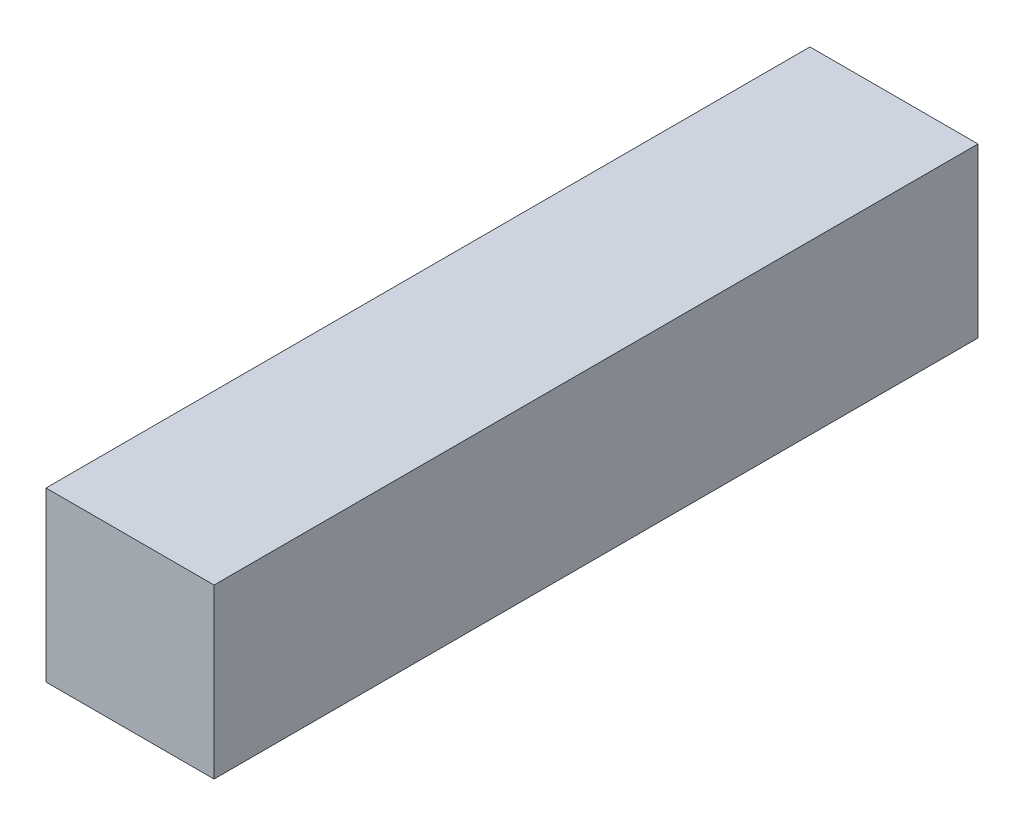
ISO-10303-21;
HEADER;
FILE_DESCRIPTION(('STEP AP214'),'2;1');
FILE_NAME('part.step','',(''),(''),'','','');
FILE_SCHEMA(('AUTOMOTIVE_DESIGN { 1 0 10303 214 1 1 1 1 }'));
ENDSEC;
DATA;
#1=APPLICATION_CONTEXT('core data for automotive mechanical design processes');
#2=APPLICATION_PROTOCOL_DEFINITION('international standard','automotive_design',2000,#1);
#3=PRODUCT_CONTEXT('',#1,'mechanical');
#4=PRODUCT('Part','Part','',(#3));
#5=PRODUCT_RELATED_PRODUCT_CATEGORY('part','',(#4));
#6=PRODUCT_DEFINITION_FORMATION('','',#4);
#7=PRODUCT_DEFINITION_CONTEXT('part definition',#1,'design');
#8=PRODUCT_DEFINITION('design','',#6,#7);
#9=PRODUCT_DEFINITION_SHAPE('','',#8);
#10=(LENGTH_UNIT() NAMED_UNIT(*) SI_UNIT(.MILLI.,.METRE.));
#11=(NAMED_UNIT(*) PLANE_ANGLE_UNIT() SI_UNIT($,.RADIAN.));
#12=(NAMED_UNIT(*) SI_UNIT($,.STERADIAN.) SOLID_ANGLE_UNIT());
#13=UNCERTAINTY_MEASURE_WITH_UNIT(LENGTH_MEASURE(1.E-05),#10,'distance_accuracy_value','');
#14=(GEOMETRIC_REPRESENTATION_CONTEXT(3) GLOBAL_UNCERTAINTY_ASSIGNED_CONTEXT((#13)) GLOBAL_UNIT_ASSIGNED_CONTEXT((#10,
#11,#12)) REPRESENTATION_CONTEXT('',''));
#15=CARTESIAN_POINT('',(0.,0.,0.));
#16=DIRECTION('',(0.,0.,1.));
#17=DIRECTION('',(1.,0.,0.));
#18=AXIS2_PLACEMENT_3D('',#15,#16,#17);
#19=CARTESIAN_POINT('',(11.,11.,100.));
#20=DIRECTION('',(-1.,0.,0.));
#21=DIRECTION('',(0.,-1.,0.));
#22=AXIS2_PLACEMENT_3D('',#19,#20,#21);
#23=PLANE('',#22);
#24=DIRECTION('',(0.,1.,0.));
#25=VECTOR('',#24,1.);
#26=CARTESIAN_POINT('',(11.,11.,0.));
#27=LINE('',#26,#25);
#28=CARTESIAN_POINT('',(11.,-11.,0.));
#29=VERTEX_POINT('',#28);
#30=CARTESIAN_POINT('',(11.,11.,0.));
#31=VERTEX_POINT('',#30);
#32=EDGE_CURVE('E96',#29,#31,#27,.T.);
#33=ORIENTED_EDGE('',*,*,#32,.T.);
#34=DIRECTION('',(0.,0.,-1.));
#35=VECTOR('',#34,1.);
#36=CARTESIAN_POINT('',(11.,11.,100.));
#37=LINE('',#36,#35);
#38=CARTESIAN_POINT('',(11.,11.,100.));
#39=VERTEX_POINT('',#38);
#40=EDGE_CURVE('E11',#39,#31,#37,.T.);
#41=ORIENTED_EDGE('',*,*,#40,.F.);
#42=DIRECTION('',(0.,1.,0.));
#43=VECTOR('',#42,1.);
#44=CARTESIAN_POINT('',(11.,11.,100.));
#45=LINE('',#44,#43);
#46=CARTESIAN_POINT('',(11.,-11.,100.));
#47=VERTEX_POINT('',#46);
#48=EDGE_CURVE('E84',#47,#39,#45,.T.);
#49=ORIENTED_EDGE('',*,*,#48,.F.);
#50=DIRECTION('',(0.,0.,-1.));
#51=VECTOR('',#50,1.);
#52=CARTESIAN_POINT('',(11.,-11.,100.));
#53=LINE('',#52,#51);
#54=EDGE_CURVE('E92',#47,#29,#53,.T.);
#55=ORIENTED_EDGE('',*,*,#54,.T.);
#56=EDGE_LOOP('',(#33,#41,#49,#55));
#57=FACE_BOUND('',#56,.T.);
#58=ADVANCED_FACE('F33',(#57),#23,.F.);
#59=CARTESIAN_POINT('',(-11.,11.,100.));
#60=DIRECTION('',(0.,-1.,0.));
#61=DIRECTION('',(0.,0.,-1.));
#62=AXIS2_PLACEMENT_3D('',#59,#60,#61);
#63=PLANE('',#62);
#64=DIRECTION('',(-1.,0.,0.));
#65=VECTOR('',#64,1.);
#66=CARTESIAN_POINT('',(-11.,11.,0.));
#67=LINE('',#66,#65);
#68=CARTESIAN_POINT('',(-11.,11.,0.));
#69=VERTEX_POINT('',#68);
#70=EDGE_CURVE('E88',#31,#69,#67,.T.);
#71=ORIENTED_EDGE('',*,*,#70,.T.);
#72=DIRECTION('',(0.,0.,-1.));
#73=VECTOR('',#72,1.);
#74=CARTESIAN_POINT('',(-11.,11.,100.));
#75=LINE('',#74,#73);
#76=CARTESIAN_POINT('',(-11.,11.,100.));
#77=VERTEX_POINT('',#76);
#78=EDGE_CURVE('E41',#77,#69,#75,.T.);
#79=ORIENTED_EDGE('',*,*,#78,.F.);
#80=DIRECTION('',(-1.,0.,0.));
#81=VECTOR('',#80,1.);
#82=CARTESIAN_POINT('',(-11.,11.,100.));
#83=LINE('',#82,#81);
#84=EDGE_CURVE('E79',#39,#77,#83,.T.);
#85=ORIENTED_EDGE('',*,*,#84,.F.);
#86=ORIENTED_EDGE('',*,*,#40,.T.);
#87=EDGE_LOOP('',(#71,#79,#85,#86));
#88=FACE_BOUND('',#87,.T.);
#89=ADVANCED_FACE('F87',(#88),#63,.F.);
#90=CARTESIAN_POINT('',(-11.,11.,100.));
#91=DIRECTION('',(1.,0.,0.));
#92=DIRECTION('',(0.,1.,0.));
#93=AXIS2_PLACEMENT_3D('',#90,#91,#92);
#94=PLANE('',#93);
#95=DIRECTION('',(0.,-1.,0.));
#96=VECTOR('',#95,1.);
#97=CARTESIAN_POINT('',(-11.,11.,0.));
#98=LINE('',#97,#96);
#99=CARTESIAN_POINT('',(-11.,-11.,0.));
#100=VERTEX_POINT('',#99);
#101=EDGE_CURVE('E66',#69,#100,#98,.T.);
#102=ORIENTED_EDGE('',*,*,#101,.T.);
#103=DIRECTION('',(0.,0.,-1.));
#104=VECTOR('',#103,1.);
#105=CARTESIAN_POINT('',(-11.,-11.,100.));
#106=LINE('',#105,#104);
#107=CARTESIAN_POINT('',(-11.,-11.,100.));
#108=VERTEX_POINT('',#107);
#109=EDGE_CURVE('E89',#108,#100,#106,.T.);
#110=ORIENTED_EDGE('',*,*,#109,.F.);
#111=DIRECTION('',(0.,-1.,0.));
#112=VECTOR('',#111,1.);
#113=CARTESIAN_POINT('',(-11.,11.,100.));
#114=LINE('',#113,#112);
#115=EDGE_CURVE('E82',#77,#108,#114,.T.);
#116=ORIENTED_EDGE('',*,*,#115,.F.);
#117=ORIENTED_EDGE('',*,*,#78,.T.);
#118=EDGE_LOOP('',(#102,#110,#116,#117));
#119=FACE_BOUND('',#118,.T.);
#120=ADVANCED_FACE('F90',(#119),#94,.F.);
#121=CARTESIAN_POINT('',(-11.,-11.,100.));
#122=DIRECTION('',(0.,1.,0.));
#123=DIRECTION('',(0.,0.,1.));
#124=AXIS2_PLACEMENT_3D('',#121,#122,#123);
#125=PLANE('',#124);
#126=DIRECTION('',(1.,0.,0.));
#127=VECTOR('',#126,1.);
#128=CARTESIAN_POINT('',(-11.,-11.,0.));
#129=LINE('',#128,#127);
#130=EDGE_CURVE('E72',#100,#29,#129,.T.);
#131=ORIENTED_EDGE('',*,*,#130,.T.);
#132=ORIENTED_EDGE('',*,*,#54,.F.);
#133=DIRECTION('',(1.,0.,0.));
#134=VECTOR('',#133,1.);
#135=CARTESIAN_POINT('',(-11.,-11.,100.));
#136=LINE('',#135,#134);
#137=EDGE_CURVE('E49',#108,#47,#136,.T.);
#138=ORIENTED_EDGE('',*,*,#137,.F.);
#139=ORIENTED_EDGE('',*,*,#109,.T.);
#140=EDGE_LOOP('',(#131,#132,#138,#139));
#141=FACE_BOUND('',#140,.T.);
#142=ADVANCED_FACE('F103',(#141),#125,.F.);
#143=CARTESIAN_POINT('',(0.,0.,100.));
#144=DIRECTION('',(0.,0.,1.));
#145=DIRECTION('',(1.,0.,0.));
#146=AXIS2_PLACEMENT_3D('',#143,#144,#145);
#147=PLANE('',#146);
#148=ORIENTED_EDGE('',*,*,#48,.T.);
#149=ORIENTED_EDGE('',*,*,#84,.T.);
#150=ORIENTED_EDGE('',*,*,#115,.T.);
#151=ORIENTED_EDGE('',*,*,#137,.T.);
#152=EDGE_LOOP('',(#148,#149,#150,#151));
#153=FACE_BOUND('',#152,.T.);
#154=ADVANCED_FACE('F80',(#153),#147,.T.);
#155=CARTESIAN_POINT('',(0.,0.,0.));
#156=DIRECTION('',(0.,0.,1.));
#157=DIRECTION('',(1.,0.,0.));
#158=AXIS2_PLACEMENT_3D('',#155,#156,#157);
#159=PLANE('',#158);
#160=ORIENTED_EDGE('',*,*,#32,.F.);
#161=ORIENTED_EDGE('',*,*,#130,.F.);
#162=ORIENTED_EDGE('',*,*,#101,.F.);
#163=ORIENTED_EDGE('',*,*,#70,.F.);
#164=EDGE_LOOP('',(#160,#161,#162,#163));
#165=FACE_BOUND('',#164,.T.);
#166=ADVANCED_FACE('F106',(#165),#159,.F.);
#167=CLOSED_SHELL('',(#58,#89,#120,#142,#154,#166));
#168=MANIFOLD_SOLID_BREP('B2',#167);
#169=ADVANCED_BREP_SHAPE_REPRESENTATION('',(#18,#168),#14);
#170=SHAPE_DEFINITION_REPRESENTATION(#9,#169);
ENDSEC;
END-ISO-10303-21;
